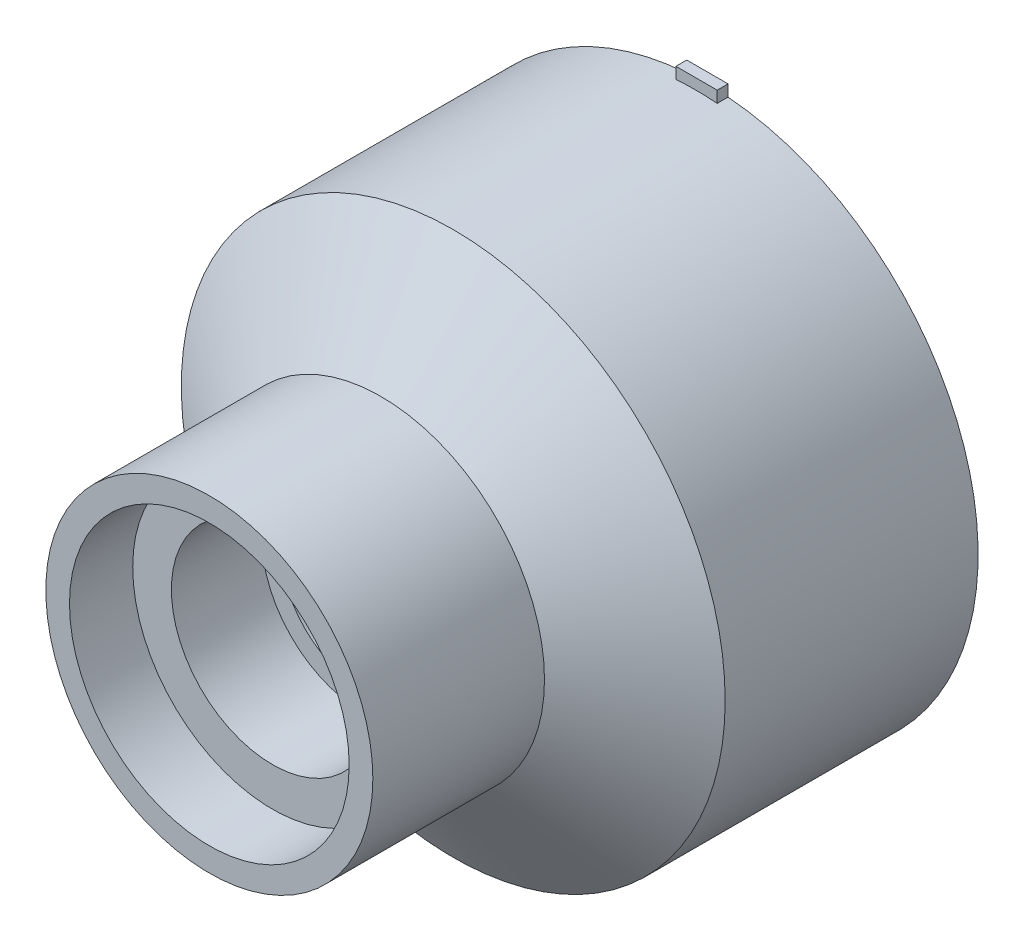
ISO-10303-21;
HEADER;
FILE_DESCRIPTION(('STEP AP214'),'2;1');
FILE_NAME('part.step','',(''),(''),'','','');
FILE_SCHEMA(('AUTOMOTIVE_DESIGN { 1 0 10303 214 1 1 1 1 }'));
ENDSEC;
DATA;
#1=APPLICATION_CONTEXT('core data for automotive mechanical design processes');
#2=APPLICATION_PROTOCOL_DEFINITION('international standard','automotive_design',2000,#1);
#3=PRODUCT_CONTEXT('',#1,'mechanical');
#4=PRODUCT('Part','Part','',(#3));
#5=PRODUCT_RELATED_PRODUCT_CATEGORY('part','',(#4));
#6=PRODUCT_DEFINITION_FORMATION('','',#4);
#7=PRODUCT_DEFINITION_CONTEXT('part definition',#1,'design');
#8=PRODUCT_DEFINITION('design','',#6,#7);
#9=PRODUCT_DEFINITION_SHAPE('','',#8);
#10=(LENGTH_UNIT() NAMED_UNIT(*) SI_UNIT(.MILLI.,.METRE.));
#11=(NAMED_UNIT(*) PLANE_ANGLE_UNIT() SI_UNIT($,.RADIAN.));
#12=(NAMED_UNIT(*) SI_UNIT($,.STERADIAN.) SOLID_ANGLE_UNIT());
#13=UNCERTAINTY_MEASURE_WITH_UNIT(LENGTH_MEASURE(1.E-05),#10,'distance_accuracy_value','');
#14=(GEOMETRIC_REPRESENTATION_CONTEXT(3) GLOBAL_UNCERTAINTY_ASSIGNED_CONTEXT((#13)) GLOBAL_UNIT_ASSIGNED_CONTEXT((#10,
#11,#12)) REPRESENTATION_CONTEXT('',''));
#15=CARTESIAN_POINT('',(0.,0.,0.));
#16=DIRECTION('',(0.,0.,1.));
#17=DIRECTION('',(1.,0.,0.));
#18=AXIS2_PLACEMENT_3D('',#15,#16,#17);
#19=CARTESIAN_POINT('',(0.,0.,0.6));
#20=DIRECTION('',(0.,0.,-1.));
#21=DIRECTION('',(-1.,0.,0.));
#22=AXIS2_PLACEMENT_3D('',#19,#20,#21);
#23=CYLINDRICAL_SURFACE('',#22,15.05);
#24=CARTESIAN_POINT('',(0.,0.,-13.4));
#25=DIRECTION('',(0.,0.,-1.));
#26=DIRECTION('',(-1.,0.,0.));
#27=AXIS2_PLACEMENT_3D('',#24,#25,#26);
#28=CIRCLE('',#27,15.05);
#29=CARTESIAN_POINT('',(1.20787808590493,15.0014509474781,-13.4));
#30=VERTEX_POINT('',#29);
#31=CARTESIAN_POINT('',(-1.07846257670084,15.0113096853891,-13.4));
#32=VERTEX_POINT('',#31);
#33=EDGE_CURVE('E109',#30,#32,#28,.T.);
#34=ORIENTED_EDGE('',*,*,#33,.F.);
#35=DIRECTION('',(0.,0.,-1.));
#36=VECTOR('',#35,1.);
#37=CARTESIAN_POINT('',(1.20787808590493,15.0014509474781,0.6));
#38=LINE('',#37,#36);
#39=CARTESIAN_POINT('',(1.20787808590493,15.0014509474781,-12.8));
#40=VERTEX_POINT('',#39);
#41=EDGE_CURVE('E103',#30,#40,#38,.F.);
#42=ORIENTED_EDGE('',*,*,#41,.T.);
#43=CARTESIAN_POINT('',(0.,0.,-12.8));
#44=DIRECTION('',(0.,0.,1.));
#45=DIRECTION('',(1.,0.,0.));
#46=AXIS2_PLACEMENT_3D('',#43,#44,#45);
#47=CIRCLE('',#46,15.05);
#48=CARTESIAN_POINT('',(-1.07846257670084,15.0113096853891,-12.8));
#49=VERTEX_POINT('',#48);
#50=EDGE_CURVE('E40',#40,#49,#47,.T.);
#51=ORIENTED_EDGE('',*,*,#50,.T.);
#52=DIRECTION('',(0.,0.,-1.));
#53=VECTOR('',#52,1.);
#54=CARTESIAN_POINT('',(-1.07846257670084,15.0113096853891,0.6));
#55=LINE('',#54,#53);
#56=EDGE_CURVE('E81',#49,#32,#55,.T.);
#57=ORIENTED_EDGE('',*,*,#56,.T.);
#58=EDGE_LOOP('',(#34,#42,#51,#57));
#59=FACE_BOUND('',#58,.T.);
#60=CARTESIAN_POINT('',(0.,0.,0.6));
#61=DIRECTION('',(0.,0.,1.));
#62=DIRECTION('',(1.,0.,0.));
#63=AXIS2_PLACEMENT_3D('',#60,#61,#62);
#64=CIRCLE('',#63,15.05);
#65=CARTESIAN_POINT('',(15.05,0.,0.6));
#66=VERTEX_POINT('',#65);
#67=EDGE_CURVE('E117',#66,#66,#64,.T.);
#68=ORIENTED_EDGE('',*,*,#67,.F.);
#69=EDGE_LOOP('',(#68));
#70=FACE_BOUND('',#69,.T.);
#71=ADVANCED_FACE('F33',(#59,#70),#23,.T.);
#72=CARTESIAN_POINT('',(0.,0.,0.6));
#73=DIRECTION('',(0.,0.,-1.));
#74=DIRECTION('',(-1.,0.,0.));
#75=AXIS2_PLACEMENT_3D('',#72,#73,#74);
#76=CYLINDRICAL_SURFACE('',#75,14.05);
#77=CARTESIAN_POINT('',(0.,0.,0.599999999999998));
#78=DIRECTION('',(0.,0.,-1.));
#79=DIRECTION('',(0.,1.,0.));
#80=AXIS2_PLACEMENT_3D('',#77,#78,#79);
#81=CIRCLE('',#80,14.05);
#82=CARTESIAN_POINT('',(0.,14.05,0.6));
#83=VERTEX_POINT('',#82);
#84=EDGE_CURVE('E111',#83,#83,#81,.T.);
#85=ORIENTED_EDGE('',*,*,#84,.F.);
#86=EDGE_LOOP('',(#85));
#87=FACE_BOUND('',#86,.T.);
#88=CARTESIAN_POINT('',(0.,0.,-13.4));
#89=DIRECTION('',(0.,0.,-1.));
#90=DIRECTION('',(-1.,0.,0.));
#91=AXIS2_PLACEMENT_3D('',#88,#89,#90);
#92=CIRCLE('',#91,14.05);
#93=CARTESIAN_POINT('',(-14.05,0.,-13.4));
#94=VERTEX_POINT('',#93);
#95=EDGE_CURVE('E106',#94,#94,#92,.T.);
#96=ORIENTED_EDGE('',*,*,#95,.T.);
#97=EDGE_LOOP('',(#96));
#98=FACE_BOUND('',#97,.T.);
#99=ADVANCED_FACE('F163',(#87,#98),#76,.F.);
#100=CARTESIAN_POINT('',(0.,0.,0.599999999999998));
#101=DIRECTION('',(0.,0.,-1.));
#102=DIRECTION('',(0.,1.,0.));
#103=AXIS2_PLACEMENT_3D('',#100,#101,#102);
#104=CONICAL_SURFACE('',#103,15.05,0.982793723247329);
#105=CARTESIAN_POINT('',(0.,0.,4.6));
#106=DIRECTION('',(0.,0.,1.));
#107=DIRECTION('',(1.,0.,0.));
#108=AXIS2_PLACEMENT_3D('',#105,#106,#107);
#109=CIRCLE('',#108,9.05);
#110=CARTESIAN_POINT('',(9.05,0.,4.6));
#111=VERTEX_POINT('',#110);
#112=EDGE_CURVE('E98',#111,#111,#109,.T.);
#113=ORIENTED_EDGE('',*,*,#112,.F.);
#114=EDGE_LOOP('',(#113));
#115=FACE_BOUND('',#114,.T.);
#116=ORIENTED_EDGE('',*,*,#67,.T.);
#117=EDGE_LOOP('',(#116));
#118=FACE_BOUND('',#117,.T.);
#119=ADVANCED_FACE('F167',(#115,#118),#104,.T.);
#120=CARTESIAN_POINT('',(0.,0.,4.6));
#121=DIRECTION('',(0.,0.,-1.));
#122=DIRECTION('',(0.,1.,0.));
#123=AXIS2_PLACEMENT_3D('',#120,#121,#122);
#124=CONICAL_SURFACE('',#123,8.05,0.982793723247329);
#125=ORIENTED_EDGE('',*,*,#84,.T.);
#126=EDGE_LOOP('',(#125));
#127=FACE_BOUND('',#126,.T.);
#128=CARTESIAN_POINT('',(0.,0.,4.6));
#129=DIRECTION('',(0.,0.,-1.));
#130=DIRECTION('',(0.,1.,0.));
#131=AXIS2_PLACEMENT_3D('',#128,#129,#130);
#132=CIRCLE('',#131,8.05);
#133=CARTESIAN_POINT('',(0.,8.05,4.6));
#134=VERTEX_POINT('',#133);
#135=EDGE_CURVE('E114',#134,#134,#132,.T.);
#136=ORIENTED_EDGE('',*,*,#135,.F.);
#137=EDGE_LOOP('',(#136));
#138=FACE_BOUND('',#137,.T.);
#139=ADVANCED_FACE('F172',(#127,#138),#124,.F.);
#140=CARTESIAN_POINT('',(0.,0.,-13.4));
#141=DIRECTION('',(0.,0.,-1.));
#142=DIRECTION('',(-1.,0.,0.));
#143=AXIS2_PLACEMENT_3D('',#140,#141,#142);
#144=PLANE('',#143);
#145=ORIENTED_EDGE('',*,*,#33,.T.);
#146=DIRECTION('',(0.,1.,0.));
#147=VECTOR('',#146,1.);
#148=CARTESIAN_POINT('',(-1.07846257670084,14.5143311522857,-13.4));
#149=LINE('',#148,#147);
#150=CARTESIAN_POINT('',(-1.07846257670084,15.6365071852894,-13.4));
#151=VERTEX_POINT('',#150);
#152=EDGE_CURVE('E97',#32,#151,#149,.T.);
#153=ORIENTED_EDGE('',*,*,#152,.T.);
#154=DIRECTION('',(1.,0.,0.));
#155=VECTOR('',#154,1.);
#156=CARTESIAN_POINT('',(1.20787808590493,15.6365071852894,-13.4));
#157=LINE('',#156,#155);
#158=CARTESIAN_POINT('',(1.20787808590493,15.6365071852894,-13.4));
#159=VERTEX_POINT('',#158);
#160=EDGE_CURVE('E89',#151,#159,#157,.T.);
#161=ORIENTED_EDGE('',*,*,#160,.T.);
#162=DIRECTION('',(0.,-1.,0.));
#163=VECTOR('',#162,1.);
#164=CARTESIAN_POINT('',(1.20787808590493,14.5143311522857,-13.4));
#165=LINE('',#164,#163);
#166=EDGE_CURVE('E47',#159,#30,#165,.T.);
#167=ORIENTED_EDGE('',*,*,#166,.T.);
#168=EDGE_LOOP('',(#145,#153,#161,#167));
#169=FACE_BOUND('',#168,.T.);
#170=ORIENTED_EDGE('',*,*,#95,.F.);
#171=EDGE_LOOP('',(#170));
#172=FACE_BOUND('',#171,.T.);
#173=ADVANCED_FACE('F180',(#169,#172),#144,.T.);
#174=CARTESIAN_POINT('',(0.,0.,-12.8));
#175=DIRECTION('',(0.,0.,1.));
#176=DIRECTION('',(1.,0.,0.));
#177=AXIS2_PLACEMENT_3D('',#174,#175,#176);
#178=PLANE('',#177);
#179=ORIENTED_EDGE('',*,*,#50,.F.);
#180=DIRECTION('',(0.,-1.,0.));
#181=VECTOR('',#180,1.);
#182=CARTESIAN_POINT('',(1.20787808590493,14.5143311522857,-12.8));
#183=LINE('',#182,#181);
#184=CARTESIAN_POINT('',(1.20787808590493,15.6365071852894,-12.8));
#185=VERTEX_POINT('',#184);
#186=EDGE_CURVE('E84',#185,#40,#183,.T.);
#187=ORIENTED_EDGE('',*,*,#186,.F.);
#188=DIRECTION('',(1.,0.,0.));
#189=VECTOR('',#188,1.);
#190=CARTESIAN_POINT('',(1.20787808590493,15.6365071852894,-12.8));
#191=LINE('',#190,#189);
#192=CARTESIAN_POINT('',(-1.07846257670084,15.6365071852894,-12.8));
#193=VERTEX_POINT('',#192);
#194=EDGE_CURVE('E83',#193,#185,#191,.T.);
#195=ORIENTED_EDGE('',*,*,#194,.F.);
#196=DIRECTION('',(0.,1.,0.));
#197=VECTOR('',#196,1.);
#198=CARTESIAN_POINT('',(-1.07846257670084,14.5143311522857,-12.8));
#199=LINE('',#198,#197);
#200=EDGE_CURVE('E75',#49,#193,#199,.T.);
#201=ORIENTED_EDGE('',*,*,#200,.F.);
#202=EDGE_LOOP('',(#179,#187,#195,#201));
#203=FACE_BOUND('',#202,.T.);
#204=ADVANCED_FACE('F92',(#203),#178,.T.);
#205=CARTESIAN_POINT('',(1.20787808590493,14.5143311522857,-12.8));
#206=DIRECTION('',(1.,0.,0.));
#207=DIRECTION('',(0.,0.,-1.));
#208=AXIS2_PLACEMENT_3D('',#205,#206,#207);
#209=PLANE('',#208);
#210=ORIENTED_EDGE('',*,*,#41,.F.);
#211=ORIENTED_EDGE('',*,*,#166,.F.);
#212=DIRECTION('',(0.,0.,-1.));
#213=VECTOR('',#212,1.);
#214=CARTESIAN_POINT('',(1.20787808590493,15.6365071852894,-12.8));
#215=LINE('',#214,#213);
#216=EDGE_CURVE('E90',#185,#159,#215,.T.);
#217=ORIENTED_EDGE('',*,*,#216,.F.);
#218=ORIENTED_EDGE('',*,*,#186,.T.);
#219=EDGE_LOOP('',(#210,#211,#217,#218));
#220=FACE_BOUND('',#219,.T.);
#221=ADVANCED_FACE('F123',(#220),#209,.T.);
#222=CARTESIAN_POINT('',(-1.07846257670084,14.5143311522857,-12.8));
#223=DIRECTION('',(-1.,0.,0.));
#224=DIRECTION('',(0.,0.,1.));
#225=AXIS2_PLACEMENT_3D('',#222,#223,#224);
#226=PLANE('',#225);
#227=ORIENTED_EDGE('',*,*,#56,.F.);
#228=ORIENTED_EDGE('',*,*,#200,.T.);
#229=DIRECTION('',(0.,0.,-1.));
#230=VECTOR('',#229,1.);
#231=CARTESIAN_POINT('',(-1.07846257670084,15.6365071852894,-12.8));
#232=LINE('',#231,#230);
#233=EDGE_CURVE('E78',#193,#151,#232,.T.);
#234=ORIENTED_EDGE('',*,*,#233,.T.);
#235=ORIENTED_EDGE('',*,*,#152,.F.);
#236=EDGE_LOOP('',(#227,#228,#234,#235));
#237=FACE_BOUND('',#236,.T.);
#238=ADVANCED_FACE('F77',(#237),#226,.T.);
#239=CARTESIAN_POINT('',(1.20787808590493,15.6365071852894,-12.8));
#240=DIRECTION('',(0.,1.,0.));
#241=DIRECTION('',(0.,0.,1.));
#242=AXIS2_PLACEMENT_3D('',#239,#240,#241);
#243=PLANE('',#242);
#244=ORIENTED_EDGE('',*,*,#160,.F.);
#245=ORIENTED_EDGE('',*,*,#233,.F.);
#246=ORIENTED_EDGE('',*,*,#194,.T.);
#247=ORIENTED_EDGE('',*,*,#216,.T.);
#248=EDGE_LOOP('',(#244,#245,#246,#247));
#249=FACE_BOUND('',#248,.T.);
#250=ADVANCED_FACE('F88',(#249),#243,.T.);
#251=CARTESIAN_POINT('',(0.,0.,31.197265478953));
#252=DIRECTION('',(0.,0.,-1.));
#253=DIRECTION('',(-1.,0.,0.));
#254=AXIS2_PLACEMENT_3D('',#251,#252,#253);
#255=CYLINDRICAL_SURFACE('',#254,9.05);
#256=ORIENTED_EDGE('',*,*,#112,.T.);
#257=EDGE_LOOP('',(#256));
#258=FACE_BOUND('',#257,.T.);
#259=CARTESIAN_POINT('',(0.,0.,14.1));
#260=DIRECTION('',(0.,0.,1.));
#261=DIRECTION('',(1.,0.,0.));
#262=AXIS2_PLACEMENT_3D('',#259,#260,#261);
#263=CIRCLE('',#262,9.05);
#264=CARTESIAN_POINT('',(9.05,0.,14.1));
#265=VERTEX_POINT('',#264);
#266=EDGE_CURVE('E139',#265,#265,#263,.T.);
#267=ORIENTED_EDGE('',*,*,#266,.F.);
#268=EDGE_LOOP('',(#267));
#269=FACE_BOUND('',#268,.T.);
#270=ADVANCED_FACE('F190',(#258,#269),#255,.T.);
#271=CARTESIAN_POINT('',(0.,0.,5.6));
#272=DIRECTION('',(0.,0.,1.));
#273=DIRECTION('',(1.,0.,0.));
#274=AXIS2_PLACEMENT_3D('',#271,#272,#273);
#275=PLANE('',#274);
#276=CARTESIAN_POINT('',(0.,0.,5.6));
#277=DIRECTION('',(0.,0.,1.));
#278=DIRECTION('',(1.,0.,0.));
#279=AXIS2_PLACEMENT_3D('',#276,#277,#278);
#280=CIRCLE('',#279,5.6);
#281=CARTESIAN_POINT('',(5.6,0.,5.6));
#282=VERTEX_POINT('',#281);
#283=EDGE_CURVE('E127',#282,#282,#280,.F.);
#284=ORIENTED_EDGE('',*,*,#283,.F.);
#285=EDGE_LOOP('',(#284));
#286=FACE_BOUND('',#285,.T.);
#287=CARTESIAN_POINT('',(0.,0.,5.6));
#288=DIRECTION('',(0.,0.,1.));
#289=DIRECTION('',(1.,0.,0.));
#290=AXIS2_PLACEMENT_3D('',#287,#288,#289);
#291=CIRCLE('',#290,4.525);
#292=CARTESIAN_POINT('',(4.525,0.,5.6));
#293=VERTEX_POINT('',#292);
#294=EDGE_CURVE('E130',#293,#293,#291,.T.);
#295=ORIENTED_EDGE('',*,*,#294,.F.);
#296=EDGE_LOOP('',(#295));
#297=FACE_BOUND('',#296,.T.);
#298=ADVANCED_FACE('F195',(#286,#297),#275,.T.);
#299=CARTESIAN_POINT('',(0.,0.,4.6));
#300=DIRECTION('',(0.,0.,1.));
#301=DIRECTION('',(1.,0.,0.));
#302=AXIS2_PLACEMENT_3D('',#299,#300,#301);
#303=PLANE('',#302);
#304=CARTESIAN_POINT('',(0.,0.,4.6));
#305=DIRECTION('',(0.,0.,1.));
#306=DIRECTION('',(1.,0.,0.));
#307=AXIS2_PLACEMENT_3D('',#304,#305,#306);
#308=CIRCLE('',#307,4.525);
#309=CARTESIAN_POINT('',(4.525,0.,4.6));
#310=VERTEX_POINT('',#309);
#311=EDGE_CURVE('E131',#310,#310,#308,.T.);
#312=ORIENTED_EDGE('',*,*,#311,.T.);
#313=EDGE_LOOP('',(#312));
#314=FACE_BOUND('',#313,.T.);
#315=ORIENTED_EDGE('',*,*,#135,.T.);
#316=EDGE_LOOP('',(#315));
#317=FACE_BOUND('',#316,.T.);
#318=ADVANCED_FACE('F197',(#314,#317),#303,.F.);
#319=CARTESIAN_POINT('',(0.,0.,5.6));
#320=DIRECTION('',(0.,0.,-1.));
#321=DIRECTION('',(-1.,0.,0.));
#322=AXIS2_PLACEMENT_3D('',#319,#320,#321);
#323=CYLINDRICAL_SURFACE('',#322,4.525);
#324=ORIENTED_EDGE('',*,*,#294,.T.);
#325=EDGE_LOOP('',(#324));
#326=FACE_BOUND('',#325,.T.);
#327=ORIENTED_EDGE('',*,*,#311,.F.);
#328=EDGE_LOOP('',(#327));
#329=FACE_BOUND('',#328,.T.);
#330=ADVANCED_FACE('F200',(#326,#329),#323,.F.);
#331=CARTESIAN_POINT('',(0.,0.,10.6));
#332=DIRECTION('',(0.,0.,1.));
#333=DIRECTION('',(1.,0.,0.));
#334=AXIS2_PLACEMENT_3D('',#331,#332,#333);
#335=PLANE('',#334);
#336=CARTESIAN_POINT('',(0.,0.,10.6));
#337=DIRECTION('',(0.,0.,1.));
#338=DIRECTION('',(1.,0.,0.));
#339=AXIS2_PLACEMENT_3D('',#336,#337,#338);
#340=CIRCLE('',#339,7.74);
#341=CARTESIAN_POINT('',(7.74,0.,10.6));
#342=VERTEX_POINT('',#341);
#343=EDGE_CURVE('E11',#342,#342,#340,.F.);
#344=ORIENTED_EDGE('',*,*,#343,.F.);
#345=EDGE_LOOP('',(#344));
#346=FACE_BOUND('',#345,.T.);
#347=CARTESIAN_POINT('',(0.,0.,10.6));
#348=DIRECTION('',(0.,0.,1.));
#349=DIRECTION('',(1.,0.,0.));
#350=AXIS2_PLACEMENT_3D('',#347,#348,#349);
#351=CIRCLE('',#350,5.6);
#352=CARTESIAN_POINT('',(5.6,0.,10.6));
#353=VERTEX_POINT('',#352);
#354=EDGE_CURVE('E134',#353,#353,#351,.T.);
#355=ORIENTED_EDGE('',*,*,#354,.F.);
#356=EDGE_LOOP('',(#355));
#357=FACE_BOUND('',#356,.T.);
#358=ADVANCED_FACE('F159',(#346,#357),#335,.T.);
#359=CARTESIAN_POINT('',(0.,0.,10.6));
#360=DIRECTION('',(0.,0.,-1.));
#361=DIRECTION('',(-1.,0.,0.));
#362=AXIS2_PLACEMENT_3D('',#359,#360,#361);
#363=CYLINDRICAL_SURFACE('',#362,5.6);
#364=ORIENTED_EDGE('',*,*,#354,.T.);
#365=EDGE_LOOP('',(#364));
#366=FACE_BOUND('',#365,.T.);
#367=ORIENTED_EDGE('',*,*,#283,.T.);
#368=EDGE_LOOP('',(#367));
#369=FACE_BOUND('',#368,.T.);
#370=ADVANCED_FACE('F151',(#366,#369),#363,.F.);
#371=CARTESIAN_POINT('',(0.,0.,14.1));
#372=DIRECTION('',(0.,0.,1.));
#373=DIRECTION('',(1.,0.,0.));
#374=AXIS2_PLACEMENT_3D('',#371,#372,#373);
#375=PLANE('',#374);
#376=ORIENTED_EDGE('',*,*,#266,.T.);
#377=EDGE_LOOP('',(#376));
#378=FACE_BOUND('',#377,.T.);
#379=CARTESIAN_POINT('',(0.,0.,14.1));
#380=DIRECTION('',(0.,0.,1.));
#381=DIRECTION('',(1.,0.,0.));
#382=AXIS2_PLACEMENT_3D('',#379,#380,#381);
#383=CIRCLE('',#382,7.74);
#384=CARTESIAN_POINT('',(7.74,0.,14.1));
#385=VERTEX_POINT('',#384);
#386=EDGE_CURVE('E142',#385,#385,#383,.T.);
#387=ORIENTED_EDGE('',*,*,#386,.F.);
#388=EDGE_LOOP('',(#387));
#389=FACE_BOUND('',#388,.T.);
#390=ADVANCED_FACE('F149',(#378,#389),#375,.T.);
#391=CARTESIAN_POINT('',(0.,0.,14.1));
#392=DIRECTION('',(0.,0.,-1.));
#393=DIRECTION('',(-1.,0.,0.));
#394=AXIS2_PLACEMENT_3D('',#391,#392,#393);
#395=CYLINDRICAL_SURFACE('',#394,7.74);
#396=ORIENTED_EDGE('',*,*,#386,.T.);
#397=EDGE_LOOP('',(#396));
#398=FACE_BOUND('',#397,.T.);
#399=ORIENTED_EDGE('',*,*,#343,.T.);
#400=EDGE_LOOP('',(#399));
#401=FACE_BOUND('',#400,.T.);
#402=ADVANCED_FACE('F146',(#398,#401),#395,.F.);
#403=CLOSED_SHELL('',(#71,#99,#119,#139,#173,#204,#221,#238,#250,#270,#298,#318,#330,#358,#370,
#390,#402));
#404=MANIFOLD_SOLID_BREP('B2',#403);
#405=ADVANCED_BREP_SHAPE_REPRESENTATION('',(#18,#404),#14);
#406=SHAPE_DEFINITION_REPRESENTATION(#9,#405);
ENDSEC;
END-ISO-10303-21;
